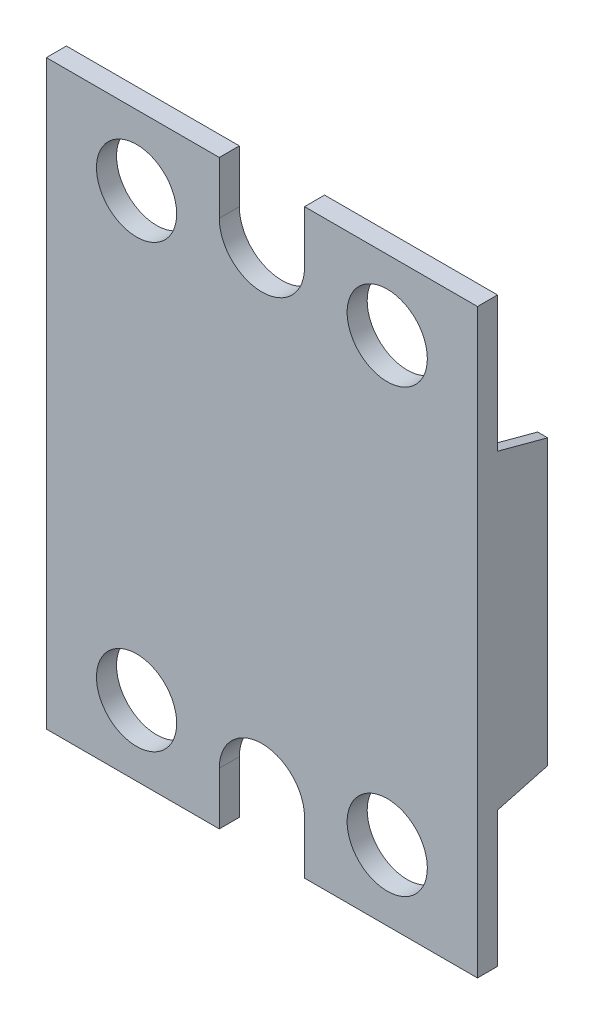
ISO-10303-21;
HEADER;
FILE_DESCRIPTION(('STEP AP214'),'2;1');
FILE_NAME('part.step','',(''),(''),'','','');
FILE_SCHEMA(('AUTOMOTIVE_DESIGN { 1 0 10303 214 1 1 1 1 }'));
ENDSEC;
DATA;
#1=APPLICATION_CONTEXT('core data for automotive mechanical design processes');
#2=APPLICATION_PROTOCOL_DEFINITION('international standard','automotive_design',2000,#1);
#3=PRODUCT_CONTEXT('',#1,'mechanical');
#4=PRODUCT('Part','Part','',(#3));
#5=PRODUCT_RELATED_PRODUCT_CATEGORY('part','',(#4));
#6=PRODUCT_DEFINITION_FORMATION('','',#4);
#7=PRODUCT_DEFINITION_CONTEXT('part definition',#1,'design');
#8=PRODUCT_DEFINITION('design','',#6,#7);
#9=PRODUCT_DEFINITION_SHAPE('','',#8);
#10=(LENGTH_UNIT() NAMED_UNIT(*) SI_UNIT(.MILLI.,.METRE.));
#11=(NAMED_UNIT(*) PLANE_ANGLE_UNIT() SI_UNIT($,.RADIAN.));
#12=(NAMED_UNIT(*) SI_UNIT($,.STERADIAN.) SOLID_ANGLE_UNIT());
#13=UNCERTAINTY_MEASURE_WITH_UNIT(LENGTH_MEASURE(1.E-05),#10,'distance_accuracy_value','');
#14=(GEOMETRIC_REPRESENTATION_CONTEXT(3) GLOBAL_UNCERTAINTY_ASSIGNED_CONTEXT((#13)) GLOBAL_UNIT_ASSIGNED_CONTEXT((#10,
#11,#12)) REPRESENTATION_CONTEXT('',''));
#15=CARTESIAN_POINT('',(0.,0.,0.));
#16=DIRECTION('',(0.,0.,1.));
#17=DIRECTION('',(1.,0.,0.));
#18=AXIS2_PLACEMENT_3D('',#15,#16,#17);
#19=CARTESIAN_POINT('',(0.,0.,-2.));
#20=DIRECTION('',(0.,0.,-1.));
#21=DIRECTION('',(-1.,0.,0.));
#22=AXIS2_PLACEMENT_3D('',#19,#20,#21);
#23=PLANE('',#22);
#24=CARTESIAN_POINT('',(12.5,22.,-2.));
#25=DIRECTION('',(0.,0.,-1.));
#26=DIRECTION('',(-1.,0.,0.));
#27=AXIS2_PLACEMENT_3D('',#24,#25,#26);
#28=CIRCLE('',#27,3.99999999999999);
#29=CARTESIAN_POINT('',(8.50000000000001,22.,-2.));
#30=VERTEX_POINT('',#29);
#31=EDGE_CURVE('E462',#30,#30,#28,.T.);
#32=ORIENTED_EDGE('',*,*,#31,.F.);
#33=EDGE_LOOP('',(#32));
#34=FACE_BOUND('',#33,.T.);
#35=CARTESIAN_POINT('',(-12.5,22.,-2.));
#36=DIRECTION('',(0.,0.,-1.));
#37=DIRECTION('',(-1.,0.,0.));
#38=AXIS2_PLACEMENT_3D('',#35,#36,#37);
#39=CIRCLE('',#38,3.99999999999999);
#40=CARTESIAN_POINT('',(-16.5,22.,-2.));
#41=VERTEX_POINT('',#40);
#42=EDGE_CURVE('E458',#41,#41,#39,.T.);
#43=ORIENTED_EDGE('',*,*,#42,.F.);
#44=EDGE_LOOP('',(#43));
#45=FACE_BOUND('',#44,.T.);
#46=CARTESIAN_POINT('',(-12.5,-22.,-2.));
#47=DIRECTION('',(0.,0.,-1.));
#48=DIRECTION('',(-1.,0.,0.));
#49=AXIS2_PLACEMENT_3D('',#46,#47,#48);
#50=CIRCLE('',#49,3.99999999999999);
#51=CARTESIAN_POINT('',(-16.5,-22.,-2.));
#52=VERTEX_POINT('',#51);
#53=EDGE_CURVE('E451',#52,#52,#50,.T.);
#54=ORIENTED_EDGE('',*,*,#53,.F.);
#55=EDGE_LOOP('',(#54));
#56=FACE_BOUND('',#55,.T.);
#57=CARTESIAN_POINT('',(12.5,-22.,-2.));
#58=DIRECTION('',(0.,0.,-1.));
#59=DIRECTION('',(-1.,0.,0.));
#60=AXIS2_PLACEMENT_3D('',#57,#58,#59);
#61=CIRCLE('',#60,3.99999999999999);
#62=CARTESIAN_POINT('',(8.50000000000001,-22.,-2.));
#63=VERTEX_POINT('',#62);
#64=EDGE_CURVE('E329',#63,#63,#61,.T.);
#65=ORIENTED_EDGE('',*,*,#64,.F.);
#66=EDGE_LOOP('',(#65));
#67=FACE_BOUND('',#66,.T.);
#68=DIRECTION('',(0.,-1.,0.));
#69=VECTOR('',#68,1.);
#70=CARTESIAN_POINT('',(-20.5,-15.5,-2.));
#71=LINE('',#70,#69);
#72=CARTESIAN_POINT('',(-20.5,15.5,-2.));
#73=VERTEX_POINT('',#72);
#74=CARTESIAN_POINT('',(-20.5,-15.5,-2.));
#75=VERTEX_POINT('',#74);
#76=EDGE_CURVE('E52',#73,#75,#71,.T.);
#77=ORIENTED_EDGE('',*,*,#76,.F.);
#78=DIRECTION('',(1.,0.,0.));
#79=VECTOR('',#78,1.);
#80=CARTESIAN_POINT('',(-20.5,15.5,-2.));
#81=LINE('',#80,#79);
#82=CARTESIAN_POINT('',(-21.5,15.5,-2.));
#83=VERTEX_POINT('',#82);
#84=EDGE_CURVE('E326',#83,#73,#81,.T.);
#85=ORIENTED_EDGE('',*,*,#84,.F.);
#86=DIRECTION('',(0.,1.,0.));
#87=VECTOR('',#86,1.);
#88=CARTESIAN_POINT('',(-21.5,-29.,-2.));
#89=LINE('',#88,#87);
#90=CARTESIAN_POINT('',(-21.5,29.,-2.));
#91=VERTEX_POINT('',#90);
#92=EDGE_CURVE('E199',#83,#91,#89,.T.);
#93=ORIENTED_EDGE('',*,*,#92,.T.);
#94=DIRECTION('',(1.,0.,0.));
#95=VECTOR('',#94,1.);
#96=CARTESIAN_POINT('',(-21.5,29.,-2.));
#97=LINE('',#96,#95);
#98=CARTESIAN_POINT('',(-4.25,29.,-2.));
#99=VERTEX_POINT('',#98);
#100=EDGE_CURVE('E204',#91,#99,#97,.T.);
#101=ORIENTED_EDGE('',*,*,#100,.T.);
#102=DIRECTION('',(0.,-1.,0.));
#103=VECTOR('',#102,1.);
#104=CARTESIAN_POINT('',(-4.25,29.,-2.));
#105=LINE('',#104,#103);
#106=CARTESIAN_POINT('',(-4.25,23.75,-2.));
#107=VERTEX_POINT('',#106);
#108=EDGE_CURVE('E154',#99,#107,#105,.T.);
#109=ORIENTED_EDGE('',*,*,#108,.T.);
#110=CARTESIAN_POINT('',(0.,23.75,-2.));
#111=DIRECTION('',(0.,0.,1.));
#112=DIRECTION('',(1.,0.,0.));
#113=AXIS2_PLACEMENT_3D('',#110,#111,#112);
#114=CIRCLE('',#113,4.25);
#115=CARTESIAN_POINT('',(4.25,23.75,-2.));
#116=VERTEX_POINT('',#115);
#117=EDGE_CURVE('E158',#107,#116,#114,.T.);
#118=ORIENTED_EDGE('',*,*,#117,.T.);
#119=DIRECTION('',(0.,1.,0.));
#120=VECTOR('',#119,1.);
#121=CARTESIAN_POINT('',(4.25,23.75,-2.));
#122=LINE('',#121,#120);
#123=CARTESIAN_POINT('',(4.25,29.,-2.));
#124=VERTEX_POINT('',#123);
#125=EDGE_CURVE('E151',#116,#124,#122,.T.);
#126=ORIENTED_EDGE('',*,*,#125,.T.);
#127=CARTESIAN_POINT('',(21.5,29.,-2.));
#128=VERTEX_POINT('',#127);
#129=EDGE_CURVE('E203',#124,#128,#97,.T.);
#130=ORIENTED_EDGE('',*,*,#129,.T.);
#131=DIRECTION('',(0.,-1.,0.));
#132=VECTOR('',#131,1.);
#133=CARTESIAN_POINT('',(21.5,29.,-2.));
#134=LINE('',#133,#132);
#135=CARTESIAN_POINT('',(21.5,15.5,-2.));
#136=VERTEX_POINT('',#135);
#137=EDGE_CURVE('E209',#128,#136,#134,.T.);
#138=ORIENTED_EDGE('',*,*,#137,.T.);
#139=DIRECTION('',(1.,0.,0.));
#140=VECTOR('',#139,1.);
#141=CARTESIAN_POINT('',(21.5,15.5,-2.));
#142=LINE('',#141,#140);
#143=CARTESIAN_POINT('',(20.5,15.5,-2.));
#144=VERTEX_POINT('',#143);
#145=EDGE_CURVE('E99',#144,#136,#142,.T.);
#146=ORIENTED_EDGE('',*,*,#145,.F.);
#147=DIRECTION('',(0.,1.,0.));
#148=VECTOR('',#147,1.);
#149=CARTESIAN_POINT('',(20.5,15.5,-2.));
#150=LINE('',#149,#148);
#151=CARTESIAN_POINT('',(20.5,-15.5,-2.));
#152=VERTEX_POINT('',#151);
#153=EDGE_CURVE('E113',#152,#144,#150,.T.);
#154=ORIENTED_EDGE('',*,*,#153,.F.);
#155=DIRECTION('',(-1.,0.,0.));
#156=VECTOR('',#155,1.);
#157=CARTESIAN_POINT('',(20.5,-15.5,-2.));
#158=LINE('',#157,#156);
#159=CARTESIAN_POINT('',(21.5,-15.5,-2.));
#160=VERTEX_POINT('',#159);
#161=EDGE_CURVE('E116',#160,#152,#158,.T.);
#162=ORIENTED_EDGE('',*,*,#161,.F.);
#163=CARTESIAN_POINT('',(21.5,-29.,-2.));
#164=VERTEX_POINT('',#163);
#165=EDGE_CURVE('E207',#160,#164,#134,.T.);
#166=ORIENTED_EDGE('',*,*,#165,.T.);
#167=DIRECTION('',(-1.,0.,0.));
#168=VECTOR('',#167,1.);
#169=CARTESIAN_POINT('',(21.5,-29.,-2.));
#170=LINE('',#169,#168);
#171=CARTESIAN_POINT('',(4.25,-29.,-2.));
#172=VERTEX_POINT('',#171);
#173=EDGE_CURVE('E196',#164,#172,#170,.T.);
#174=ORIENTED_EDGE('',*,*,#173,.T.);
#175=DIRECTION('',(0.,1.,0.));
#176=VECTOR('',#175,1.);
#177=CARTESIAN_POINT('',(4.25,-29.,-2.));
#178=LINE('',#177,#176);
#179=CARTESIAN_POINT('',(4.25,-23.75,-2.));
#180=VERTEX_POINT('',#179);
#181=EDGE_CURVE('E122',#172,#180,#178,.T.);
#182=ORIENTED_EDGE('',*,*,#181,.T.);
#183=CARTESIAN_POINT('',(0.,-23.75,-2.));
#184=DIRECTION('',(0.,0.,1.));
#185=DIRECTION('',(1.,0.,0.));
#186=AXIS2_PLACEMENT_3D('',#183,#184,#185);
#187=CIRCLE('',#186,4.25);
#188=CARTESIAN_POINT('',(-4.25,-23.75,-2.));
#189=VERTEX_POINT('',#188);
#190=EDGE_CURVE('E126',#180,#189,#187,.T.);
#191=ORIENTED_EDGE('',*,*,#190,.T.);
#192=DIRECTION('',(0.,-1.,0.));
#193=VECTOR('',#192,1.);
#194=CARTESIAN_POINT('',(-4.25,-23.75,-2.));
#195=LINE('',#194,#193);
#196=CARTESIAN_POINT('',(-4.25,-29.,-2.));
#197=VERTEX_POINT('',#196);
#198=EDGE_CURVE('E119',#189,#197,#195,.T.);
#199=ORIENTED_EDGE('',*,*,#198,.T.);
#200=CARTESIAN_POINT('',(-21.5,-29.,-2.));
#201=VERTEX_POINT('',#200);
#202=EDGE_CURVE('E172',#197,#201,#170,.T.);
#203=ORIENTED_EDGE('',*,*,#202,.T.);
#204=CARTESIAN_POINT('',(-21.5,-15.5,-2.));
#205=VERTEX_POINT('',#204);
#206=EDGE_CURVE('E200',#201,#205,#89,.T.);
#207=ORIENTED_EDGE('',*,*,#206,.T.);
#208=DIRECTION('',(-1.,0.,0.));
#209=VECTOR('',#208,1.);
#210=CARTESIAN_POINT('',(-21.5,-15.5,-2.));
#211=LINE('',#210,#209);
#212=EDGE_CURVE('E240',#75,#205,#211,.T.);
#213=ORIENTED_EDGE('',*,*,#212,.F.);
#214=EDGE_LOOP('',(#77,#85,#93,#101,#109,#118,#126,#130,#138,#146,#154,#162,#166,#174,#182,#191,
#199,#203,#207,#213));
#215=FACE_BOUND('',#214,.T.);
#216=ADVANCED_FACE('F33',(#34,#45,#56,#67,#215),#23,.T.);
#217=CARTESIAN_POINT('',(21.5,-29.,0.));
#218=DIRECTION('',(0.,-1.,0.));
#219=DIRECTION('',(0.,0.,-1.));
#220=AXIS2_PLACEMENT_3D('',#217,#218,#219);
#221=PLANE('',#220);
#222=DIRECTION('',(0.,0.,1.));
#223=VECTOR('',#222,1.);
#224=CARTESIAN_POINT('',(-4.25,-29.,-2.));
#225=LINE('',#224,#223);
#226=CARTESIAN_POINT('',(-4.25,-29.,0.));
#227=VERTEX_POINT('',#226);
#228=EDGE_CURVE('E129',#197,#227,#225,.T.);
#229=ORIENTED_EDGE('',*,*,#228,.T.);
#230=DIRECTION('',(-1.,0.,0.));
#231=VECTOR('',#230,1.);
#232=CARTESIAN_POINT('',(21.5,-29.,0.));
#233=LINE('',#232,#231);
#234=CARTESIAN_POINT('',(-21.5,-29.,0.));
#235=VERTEX_POINT('',#234);
#236=EDGE_CURVE('E185',#227,#235,#233,.T.);
#237=ORIENTED_EDGE('',*,*,#236,.T.);
#238=DIRECTION('',(0.,0.,-1.));
#239=VECTOR('',#238,1.);
#240=CARTESIAN_POINT('',(-21.5,-29.,0.));
#241=LINE('',#240,#239);
#242=EDGE_CURVE('E195',#235,#201,#241,.T.);
#243=ORIENTED_EDGE('',*,*,#242,.T.);
#244=ORIENTED_EDGE('',*,*,#202,.F.);
#245=EDGE_LOOP('',(#229,#237,#243,#244));
#246=FACE_BOUND('',#245,.T.);
#247=ADVANCED_FACE('F348',(#246),#221,.T.);
#248=CARTESIAN_POINT('',(-21.5,29.,0.));
#249=DIRECTION('',(0.,1.,0.));
#250=DIRECTION('',(0.,0.,1.));
#251=AXIS2_PLACEMENT_3D('',#248,#249,#250);
#252=PLANE('',#251);
#253=DIRECTION('',(0.,0.,1.));
#254=VECTOR('',#253,1.);
#255=CARTESIAN_POINT('',(4.25,29.,-2.));
#256=LINE('',#255,#254);
#257=CARTESIAN_POINT('',(4.25,29.,0.));
#258=VERTEX_POINT('',#257);
#259=EDGE_CURVE('E161',#124,#258,#256,.T.);
#260=ORIENTED_EDGE('',*,*,#259,.T.);
#261=DIRECTION('',(1.,0.,0.));
#262=VECTOR('',#261,1.);
#263=CARTESIAN_POINT('',(-21.5,29.,0.));
#264=LINE('',#263,#262);
#265=CARTESIAN_POINT('',(21.5,29.,0.));
#266=VERTEX_POINT('',#265);
#267=EDGE_CURVE('E188',#258,#266,#264,.T.);
#268=ORIENTED_EDGE('',*,*,#267,.T.);
#269=DIRECTION('',(0.,0.,-1.));
#270=VECTOR('',#269,1.);
#271=CARTESIAN_POINT('',(21.5,29.,0.));
#272=LINE('',#271,#270);
#273=EDGE_CURVE('E43',#266,#128,#272,.T.);
#274=ORIENTED_EDGE('',*,*,#273,.T.);
#275=ORIENTED_EDGE('',*,*,#129,.F.);
#276=EDGE_LOOP('',(#260,#268,#274,#275));
#277=FACE_BOUND('',#276,.T.);
#278=ADVANCED_FACE('F387',(#277),#252,.T.);
#279=DIRECTION('',(0.,0.,1.));
#280=VECTOR('',#279,1.);
#281=CARTESIAN_POINT('',(4.25,-29.,-2.));
#282=LINE('',#281,#280);
#283=CARTESIAN_POINT('',(4.25,-29.,0.));
#284=VERTEX_POINT('',#283);
#285=EDGE_CURVE('E146',#172,#284,#282,.T.);
#286=ORIENTED_EDGE('',*,*,#285,.F.);
#287=ORIENTED_EDGE('',*,*,#173,.F.);
#288=DIRECTION('',(0.,0.,-1.));
#289=VECTOR('',#288,1.);
#290=CARTESIAN_POINT('',(21.5,-29.,0.));
#291=LINE('',#290,#289);
#292=CARTESIAN_POINT('',(21.5,-29.,0.));
#293=VERTEX_POINT('',#292);
#294=EDGE_CURVE('E11',#293,#164,#291,.T.);
#295=ORIENTED_EDGE('',*,*,#294,.F.);
#296=EDGE_CURVE('E181',#293,#284,#233,.T.);
#297=ORIENTED_EDGE('',*,*,#296,.T.);
#298=EDGE_LOOP('',(#286,#287,#295,#297));
#299=FACE_BOUND('',#298,.T.);
#300=ADVANCED_FACE('F364',(#299),#221,.T.);
#301=CARTESIAN_POINT('',(21.5,29.,0.));
#302=DIRECTION('',(1.,0.,0.));
#303=DIRECTION('',(0.,0.,-1.));
#304=AXIS2_PLACEMENT_3D('',#301,#302,#303);
#305=PLANE('',#304);
#306=ORIENTED_EDGE('',*,*,#137,.F.);
#307=ORIENTED_EDGE('',*,*,#273,.F.);
#308=DIRECTION('',(0.,-1.,0.));
#309=VECTOR('',#308,1.);
#310=CARTESIAN_POINT('',(21.5,29.,0.));
#311=LINE('',#310,#309);
#312=EDGE_CURVE('E192',#266,#293,#311,.T.);
#313=ORIENTED_EDGE('',*,*,#312,.T.);
#314=ORIENTED_EDGE('',*,*,#294,.T.);
#315=ORIENTED_EDGE('',*,*,#165,.F.);
#316=DIRECTION('',(0.,0.258819045102524,-0.965925826289068));
#317=VECTOR('',#316,1.);
#318=CARTESIAN_POINT('',(21.5,-13.0190652342037,-11.2589745962157));
#319=LINE('',#318,#317);
#320=CARTESIAN_POINT('',(21.5,-14.1602540378444,-7.));
#321=VERTEX_POINT('',#320);
#322=EDGE_CURVE('E103',#321,#160,#319,.F.);
#323=ORIENTED_EDGE('',*,*,#322,.F.);
#324=DIRECTION('',(0.,-1.,0.));
#325=VECTOR('',#324,1.);
#326=CARTESIAN_POINT('',(21.5,-15.5,-7.));
#327=LINE('',#326,#325);
#328=CARTESIAN_POINT('',(21.5,14.1602540378444,-7.));
#329=VERTEX_POINT('',#328);
#330=EDGE_CURVE('E90',#329,#321,#327,.T.);
#331=ORIENTED_EDGE('',*,*,#330,.F.);
#332=DIRECTION('',(0.,-0.258819045102524,-0.965925826289068));
#333=VECTOR('',#332,1.);
#334=CARTESIAN_POINT('',(21.5,15.5,-2.));
#335=LINE('',#334,#333);
#336=EDGE_CURVE('E37',#329,#136,#335,.F.);
#337=ORIENTED_EDGE('',*,*,#336,.T.);
#338=EDGE_LOOP('',(#306,#307,#313,#314,#315,#323,#331,#337));
#339=FACE_BOUND('',#338,.T.);
#340=ADVANCED_FACE('F104',(#339),#305,.T.);
#341=DIRECTION('',(0.,0.,1.));
#342=VECTOR('',#341,1.);
#343=CARTESIAN_POINT('',(-4.25,29.,-2.));
#344=LINE('',#343,#342);
#345=CARTESIAN_POINT('',(-4.25,29.,0.));
#346=VERTEX_POINT('',#345);
#347=EDGE_CURVE('E176',#99,#346,#344,.T.);
#348=ORIENTED_EDGE('',*,*,#347,.F.);
#349=ORIENTED_EDGE('',*,*,#100,.F.);
#350=DIRECTION('',(0.,0.,-1.));
#351=VECTOR('',#350,1.);
#352=CARTESIAN_POINT('',(-21.5,29.,0.));
#353=LINE('',#352,#351);
#354=CARTESIAN_POINT('',(-21.5,29.,0.));
#355=VERTEX_POINT('',#354);
#356=EDGE_CURVE('E213',#355,#91,#353,.T.);
#357=ORIENTED_EDGE('',*,*,#356,.F.);
#358=EDGE_CURVE('E189',#355,#346,#264,.T.);
#359=ORIENTED_EDGE('',*,*,#358,.T.);
#360=EDGE_LOOP('',(#348,#349,#357,#359));
#361=FACE_BOUND('',#360,.T.);
#362=ADVANCED_FACE('F395',(#361),#252,.T.);
#363=CARTESIAN_POINT('',(-21.5,-29.,0.));
#364=DIRECTION('',(-1.,0.,0.));
#365=DIRECTION('',(0.,0.,1.));
#366=AXIS2_PLACEMENT_3D('',#363,#364,#365);
#367=PLANE('',#366);
#368=ORIENTED_EDGE('',*,*,#206,.F.);
#369=ORIENTED_EDGE('',*,*,#242,.F.);
#370=DIRECTION('',(0.,1.,0.));
#371=VECTOR('',#370,1.);
#372=CARTESIAN_POINT('',(-21.5,-29.,0.));
#373=LINE('',#372,#371);
#374=EDGE_CURVE('E184',#235,#355,#373,.T.);
#375=ORIENTED_EDGE('',*,*,#374,.T.);
#376=ORIENTED_EDGE('',*,*,#356,.T.);
#377=ORIENTED_EDGE('',*,*,#92,.F.);
#378=DIRECTION('',(0.,-0.258819045102524,-0.965925826289068));
#379=VECTOR('',#378,1.);
#380=CARTESIAN_POINT('',(-21.5,13.0190652342037,-11.2589745962157));
#381=LINE('',#380,#379);
#382=CARTESIAN_POINT('',(-21.5,14.1602540378444,-7.));
#383=VERTEX_POINT('',#382);
#384=EDGE_CURVE('E234',#383,#83,#381,.F.);
#385=ORIENTED_EDGE('',*,*,#384,.F.);
#386=DIRECTION('',(0.,1.,0.));
#387=VECTOR('',#386,1.);
#388=CARTESIAN_POINT('',(-21.5,15.5,-7.));
#389=LINE('',#388,#387);
#390=CARTESIAN_POINT('',(-21.5,-14.1602540378444,-7.));
#391=VERTEX_POINT('',#390);
#392=EDGE_CURVE('E230',#391,#383,#389,.T.);
#393=ORIENTED_EDGE('',*,*,#392,.F.);
#394=DIRECTION('',(0.,0.258819045102524,-0.965925826289068));
#395=VECTOR('',#394,1.);
#396=CARTESIAN_POINT('',(-21.5,-15.5,-2.));
#397=LINE('',#396,#395);
#398=EDGE_CURVE('E227',#391,#205,#397,.F.);
#399=ORIENTED_EDGE('',*,*,#398,.T.);
#400=EDGE_LOOP('',(#368,#369,#375,#376,#377,#385,#393,#399));
#401=FACE_BOUND('',#400,.T.);
#402=ADVANCED_FACE('F321',(#401),#367,.T.);
#403=CARTESIAN_POINT('',(0.,0.,0.));
#404=DIRECTION('',(0.,0.,-1.));
#405=DIRECTION('',(-1.,0.,0.));
#406=AXIS2_PLACEMENT_3D('',#403,#404,#405);
#407=PLANE('',#406);
#408=CARTESIAN_POINT('',(12.5,22.,0.));
#409=DIRECTION('',(0.,0.,1.));
#410=DIRECTION('',(1.,0.,0.));
#411=AXIS2_PLACEMENT_3D('',#408,#409,#410);
#412=CIRCLE('',#411,3.99999999999999);
#413=CARTESIAN_POINT('',(16.5,22.,0.));
#414=VERTEX_POINT('',#413);
#415=EDGE_CURVE('E438',#414,#414,#412,.T.);
#416=ORIENTED_EDGE('',*,*,#415,.F.);
#417=EDGE_LOOP('',(#416));
#418=FACE_BOUND('',#417,.T.);
#419=CARTESIAN_POINT('',(-12.5,22.,0.));
#420=DIRECTION('',(0.,0.,1.));
#421=DIRECTION('',(1.,0.,0.));
#422=AXIS2_PLACEMENT_3D('',#419,#420,#421);
#423=CIRCLE('',#422,3.99999999999999);
#424=CARTESIAN_POINT('',(-8.50000000000001,22.,0.));
#425=VERTEX_POINT('',#424);
#426=EDGE_CURVE('E442',#425,#425,#423,.T.);
#427=ORIENTED_EDGE('',*,*,#426,.F.);
#428=EDGE_LOOP('',(#427));
#429=FACE_BOUND('',#428,.T.);
#430=CARTESIAN_POINT('',(-12.5,-22.,0.));
#431=DIRECTION('',(0.,0.,1.));
#432=DIRECTION('',(1.,0.,0.));
#433=AXIS2_PLACEMENT_3D('',#430,#431,#432);
#434=CIRCLE('',#433,3.99999999999999);
#435=CARTESIAN_POINT('',(-8.50000000000001,-22.,0.));
#436=VERTEX_POINT('',#435);
#437=EDGE_CURVE('E446',#436,#436,#434,.T.);
#438=ORIENTED_EDGE('',*,*,#437,.F.);
#439=EDGE_LOOP('',(#438));
#440=FACE_BOUND('',#439,.T.);
#441=CARTESIAN_POINT('',(12.5,-22.,0.));
#442=DIRECTION('',(0.,0.,1.));
#443=DIRECTION('',(1.,0.,0.));
#444=AXIS2_PLACEMENT_3D('',#441,#442,#443);
#445=CIRCLE('',#444,3.99999999999999);
#446=CARTESIAN_POINT('',(16.5,-22.,0.));
#447=VERTEX_POINT('',#446);
#448=EDGE_CURVE('E449',#447,#447,#445,.T.);
#449=ORIENTED_EDGE('',*,*,#448,.F.);
#450=EDGE_LOOP('',(#449));
#451=FACE_BOUND('',#450,.T.);
#452=ORIENTED_EDGE('',*,*,#236,.F.);
#453=DIRECTION('',(0.,-1.,0.));
#454=VECTOR('',#453,1.);
#455=CARTESIAN_POINT('',(-4.25,-23.75,0.));
#456=LINE('',#455,#454);
#457=CARTESIAN_POINT('',(-4.25,-23.75,0.));
#458=VERTEX_POINT('',#457);
#459=EDGE_CURVE('E130',#458,#227,#456,.T.);
#460=ORIENTED_EDGE('',*,*,#459,.F.);
#461=CARTESIAN_POINT('',(0.,-23.75,0.));
#462=DIRECTION('',(0.,0.,1.));
#463=DIRECTION('',(1.,0.,0.));
#464=AXIS2_PLACEMENT_3D('',#461,#462,#463);
#465=CIRCLE('',#464,4.25);
#466=CARTESIAN_POINT('',(4.25,-23.75,0.));
#467=VERTEX_POINT('',#466);
#468=EDGE_CURVE('E123',#467,#458,#465,.T.);
#469=ORIENTED_EDGE('',*,*,#468,.F.);
#470=DIRECTION('',(0.,1.,0.));
#471=VECTOR('',#470,1.);
#472=CARTESIAN_POINT('',(4.25,-29.,0.));
#473=LINE('',#472,#471);
#474=EDGE_CURVE('E133',#284,#467,#473,.T.);
#475=ORIENTED_EDGE('',*,*,#474,.F.);
#476=ORIENTED_EDGE('',*,*,#296,.F.);
#477=ORIENTED_EDGE('',*,*,#312,.F.);
#478=ORIENTED_EDGE('',*,*,#267,.F.);
#479=DIRECTION('',(0.,1.,0.));
#480=VECTOR('',#479,1.);
#481=CARTESIAN_POINT('',(4.25,23.75,0.));
#482=LINE('',#481,#480);
#483=CARTESIAN_POINT('',(4.25,23.75,0.));
#484=VERTEX_POINT('',#483);
#485=EDGE_CURVE('E142',#484,#258,#482,.T.);
#486=ORIENTED_EDGE('',*,*,#485,.F.);
#487=CARTESIAN_POINT('',(0.,23.75,0.));
#488=DIRECTION('',(0.,0.,1.));
#489=DIRECTION('',(1.,0.,0.));
#490=AXIS2_PLACEMENT_3D('',#487,#488,#489);
#491=CIRCLE('',#490,4.25);
#492=CARTESIAN_POINT('',(-4.25,23.75,0.));
#493=VERTEX_POINT('',#492);
#494=EDGE_CURVE('E155',#493,#484,#491,.T.);
#495=ORIENTED_EDGE('',*,*,#494,.F.);
#496=DIRECTION('',(0.,-1.,0.));
#497=VECTOR('',#496,1.);
#498=CARTESIAN_POINT('',(-4.25,29.,0.));
#499=LINE('',#498,#497);
#500=EDGE_CURVE('E164',#346,#493,#499,.T.);
#501=ORIENTED_EDGE('',*,*,#500,.F.);
#502=ORIENTED_EDGE('',*,*,#358,.F.);
#503=ORIENTED_EDGE('',*,*,#374,.F.);
#504=EDGE_LOOP('',(#452,#460,#469,#475,#476,#477,#478,#486,#495,#501,#502,#503));
#505=FACE_BOUND('',#504,.T.);
#506=ADVANCED_FACE('F358',(#418,#429,#440,#451,#505),#407,.F.);
#507=CARTESIAN_POINT('',(4.25,23.75,-2.));
#508=DIRECTION('',(1.,0.,0.));
#509=DIRECTION('',(0.,0.,-1.));
#510=AXIS2_PLACEMENT_3D('',#507,#508,#509);
#511=PLANE('',#510);
#512=ORIENTED_EDGE('',*,*,#485,.T.);
#513=ORIENTED_EDGE('',*,*,#259,.F.);
#514=ORIENTED_EDGE('',*,*,#125,.F.);
#515=DIRECTION('',(0.,0.,1.));
#516=VECTOR('',#515,1.);
#517=CARTESIAN_POINT('',(4.25,23.75,-2.));
#518=LINE('',#517,#516);
#519=EDGE_CURVE('E169',#116,#484,#518,.T.);
#520=ORIENTED_EDGE('',*,*,#519,.T.);
#521=EDGE_LOOP('',(#512,#513,#514,#520));
#522=FACE_BOUND('',#521,.T.);
#523=ADVANCED_FACE('F408',(#522),#511,.F.);
#524=CARTESIAN_POINT('',(0.,23.75,-2.));
#525=DIRECTION('',(0.,0.,1.));
#526=DIRECTION('',(1.,0.,0.));
#527=AXIS2_PLACEMENT_3D('',#524,#525,#526);
#528=CYLINDRICAL_SURFACE('',#527,4.25);
#529=ORIENTED_EDGE('',*,*,#494,.T.);
#530=ORIENTED_EDGE('',*,*,#519,.F.);
#531=ORIENTED_EDGE('',*,*,#117,.F.);
#532=DIRECTION('',(0.,0.,1.));
#533=VECTOR('',#532,1.);
#534=CARTESIAN_POINT('',(-4.25,23.75,-2.));
#535=LINE('',#534,#533);
#536=EDGE_CURVE('E173',#107,#493,#535,.T.);
#537=ORIENTED_EDGE('',*,*,#536,.T.);
#538=EDGE_LOOP('',(#529,#530,#531,#537));
#539=FACE_BOUND('',#538,.T.);
#540=ADVANCED_FACE('F411',(#539),#528,.F.);
#541=CARTESIAN_POINT('',(-4.25,29.,-2.));
#542=DIRECTION('',(-1.,0.,0.));
#543=DIRECTION('',(0.,0.,1.));
#544=AXIS2_PLACEMENT_3D('',#541,#542,#543);
#545=PLANE('',#544);
#546=ORIENTED_EDGE('',*,*,#500,.T.);
#547=ORIENTED_EDGE('',*,*,#536,.F.);
#548=ORIENTED_EDGE('',*,*,#108,.F.);
#549=ORIENTED_EDGE('',*,*,#347,.T.);
#550=EDGE_LOOP('',(#546,#547,#548,#549));
#551=FACE_BOUND('',#550,.T.);
#552=ADVANCED_FACE('F413',(#551),#545,.F.);
#553=CARTESIAN_POINT('',(-4.25,-23.75,-2.));
#554=DIRECTION('',(-1.,0.,0.));
#555=DIRECTION('',(0.,0.,1.));
#556=AXIS2_PLACEMENT_3D('',#553,#554,#555);
#557=PLANE('',#556);
#558=ORIENTED_EDGE('',*,*,#459,.T.);
#559=ORIENTED_EDGE('',*,*,#228,.F.);
#560=ORIENTED_EDGE('',*,*,#198,.F.);
#561=DIRECTION('',(0.,0.,1.));
#562=VECTOR('',#561,1.);
#563=CARTESIAN_POINT('',(-4.25,-23.75,-2.));
#564=LINE('',#563,#562);
#565=EDGE_CURVE('E139',#189,#458,#564,.T.);
#566=ORIENTED_EDGE('',*,*,#565,.T.);
#567=EDGE_LOOP('',(#558,#559,#560,#566));
#568=FACE_BOUND('',#567,.T.);
#569=ADVANCED_FACE('F419',(#568),#557,.F.);
#570=CARTESIAN_POINT('',(0.,-23.75,-2.));
#571=DIRECTION('',(0.,0.,1.));
#572=DIRECTION('',(1.,0.,0.));
#573=AXIS2_PLACEMENT_3D('',#570,#571,#572);
#574=CYLINDRICAL_SURFACE('',#573,4.25);
#575=ORIENTED_EDGE('',*,*,#468,.T.);
#576=ORIENTED_EDGE('',*,*,#565,.F.);
#577=ORIENTED_EDGE('',*,*,#190,.F.);
#578=DIRECTION('',(0.,0.,1.));
#579=VECTOR('',#578,1.);
#580=CARTESIAN_POINT('',(4.25,-23.75,-2.));
#581=LINE('',#580,#579);
#582=EDGE_CURVE('E143',#180,#467,#581,.T.);
#583=ORIENTED_EDGE('',*,*,#582,.T.);
#584=EDGE_LOOP('',(#575,#576,#577,#583));
#585=FACE_BOUND('',#584,.T.);
#586=ADVANCED_FACE('F376',(#585),#574,.F.);
#587=CARTESIAN_POINT('',(4.25,-29.,-2.));
#588=DIRECTION('',(1.,0.,0.));
#589=DIRECTION('',(0.,0.,-1.));
#590=AXIS2_PLACEMENT_3D('',#587,#588,#589);
#591=PLANE('',#590);
#592=ORIENTED_EDGE('',*,*,#474,.T.);
#593=ORIENTED_EDGE('',*,*,#582,.F.);
#594=ORIENTED_EDGE('',*,*,#181,.F.);
#595=ORIENTED_EDGE('',*,*,#285,.T.);
#596=EDGE_LOOP('',(#592,#593,#594,#595));
#597=FACE_BOUND('',#596,.T.);
#598=ADVANCED_FACE('F369',(#597),#591,.F.);
#599=CARTESIAN_POINT('',(20.5,-15.5,-2.));
#600=DIRECTION('',(0.,-0.965925826289067,-0.258819045102524));
#601=DIRECTION('',(0.,0.258819045102524,-0.965925826289068));
#602=AXIS2_PLACEMENT_3D('',#599,#600,#601);
#603=PLANE('',#602);
#604=ORIENTED_EDGE('',*,*,#161,.T.);
#605=DIRECTION('',(0.,0.258819045102524,-0.965925826289068));
#606=VECTOR('',#605,1.);
#607=CARTESIAN_POINT('',(20.5,-12.1733937586587,-14.4150635094612));
#608=LINE('',#607,#606);
#609=CARTESIAN_POINT('',(20.5,-14.1602540378444,-7.));
#610=VERTEX_POINT('',#609);
#611=EDGE_CURVE('E134',#610,#152,#608,.F.);
#612=ORIENTED_EDGE('',*,*,#611,.F.);
#613=DIRECTION('',(1.,0.,0.));
#614=VECTOR('',#613,1.);
#615=CARTESIAN_POINT('',(0.,-14.1602540378444,-7.));
#616=LINE('',#615,#614);
#617=EDGE_CURVE('E118',#321,#610,#616,.F.);
#618=ORIENTED_EDGE('',*,*,#617,.F.);
#619=ORIENTED_EDGE('',*,*,#322,.T.);
#620=EDGE_LOOP('',(#604,#612,#618,#619));
#621=FACE_BOUND('',#620,.T.);
#622=ADVANCED_FACE('F367',(#621),#603,.T.);
#623=CARTESIAN_POINT('',(20.5,15.5,-7.));
#624=DIRECTION('',(1.,0.,0.));
#625=DIRECTION('',(0.,0.,-1.));
#626=AXIS2_PLACEMENT_3D('',#623,#624,#625);
#627=PLANE('',#626);
#628=ORIENTED_EDGE('',*,*,#153,.T.);
#629=DIRECTION('',(0.,-0.258819045102524,-0.965925826289068));
#630=VECTOR('',#629,1.);
#631=CARTESIAN_POINT('',(20.5,15.5,-2.));
#632=LINE('',#631,#630);
#633=CARTESIAN_POINT('',(20.5,14.1602540378444,-7.));
#634=VERTEX_POINT('',#633);
#635=EDGE_CURVE('E102',#634,#144,#632,.F.);
#636=ORIENTED_EDGE('',*,*,#635,.F.);
#637=DIRECTION('',(0.,1.,0.));
#638=VECTOR('',#637,1.);
#639=CARTESIAN_POINT('',(20.5,15.5,-7.));
#640=LINE('',#639,#638);
#641=EDGE_CURVE('E83',#610,#634,#640,.T.);
#642=ORIENTED_EDGE('',*,*,#641,.F.);
#643=ORIENTED_EDGE('',*,*,#611,.T.);
#644=EDGE_LOOP('',(#628,#636,#642,#643));
#645=FACE_BOUND('',#644,.T.);
#646=ADVANCED_FACE('F244',(#645),#627,.F.);
#647=CARTESIAN_POINT('',(21.5,15.5,-2.));
#648=DIRECTION('',(0.,0.965925826289067,-0.258819045102524));
#649=DIRECTION('',(0.,0.258819045102524,0.965925826289068));
#650=AXIS2_PLACEMENT_3D('',#647,#648,#649);
#651=PLANE('',#650);
#652=ORIENTED_EDGE('',*,*,#145,.T.);
#653=ORIENTED_EDGE('',*,*,#336,.F.);
#654=DIRECTION('',(-1.,0.,0.));
#655=VECTOR('',#654,1.);
#656=CARTESIAN_POINT('',(0.,14.1602540378444,-7.));
#657=LINE('',#656,#655);
#658=EDGE_CURVE('E86',#634,#329,#657,.F.);
#659=ORIENTED_EDGE('',*,*,#658,.F.);
#660=ORIENTED_EDGE('',*,*,#635,.T.);
#661=EDGE_LOOP('',(#652,#653,#659,#660));
#662=FACE_BOUND('',#661,.T.);
#663=ADVANCED_FACE('F96',(#662),#651,.T.);
#664=CARTESIAN_POINT('',(0.,0.,-7.));
#665=DIRECTION('',(0.,0.,1.));
#666=DIRECTION('',(1.,0.,0.));
#667=AXIS2_PLACEMENT_3D('',#664,#665,#666);
#668=PLANE('',#667);
#669=ORIENTED_EDGE('',*,*,#617,.T.);
#670=ORIENTED_EDGE('',*,*,#641,.T.);
#671=ORIENTED_EDGE('',*,*,#658,.T.);
#672=ORIENTED_EDGE('',*,*,#330,.T.);
#673=EDGE_LOOP('',(#669,#670,#671,#672));
#674=FACE_BOUND('',#673,.T.);
#675=ADVANCED_FACE('F88',(#674),#668,.F.);
#676=CARTESIAN_POINT('',(-20.5,15.5,-2.));
#677=DIRECTION('',(0.,0.965925826289067,-0.258819045102524));
#678=DIRECTION('',(0.,0.258819045102524,0.965925826289068));
#679=AXIS2_PLACEMENT_3D('',#676,#677,#678);
#680=PLANE('',#679);
#681=ORIENTED_EDGE('',*,*,#84,.T.);
#682=DIRECTION('',(0.,-0.258819045102524,-0.965925826289068));
#683=VECTOR('',#682,1.);
#684=CARTESIAN_POINT('',(-20.5,12.1733937586587,-14.4150635094612));
#685=LINE('',#684,#683);
#686=CARTESIAN_POINT('',(-20.5,14.1602540378444,-7.));
#687=VERTEX_POINT('',#686);
#688=EDGE_CURVE('E219',#687,#73,#685,.F.);
#689=ORIENTED_EDGE('',*,*,#688,.F.);
#690=DIRECTION('',(-1.,0.,0.));
#691=VECTOR('',#690,1.);
#692=CARTESIAN_POINT('',(0.,14.1602540378444,-7.));
#693=LINE('',#692,#691);
#694=EDGE_CURVE('E237',#383,#687,#693,.F.);
#695=ORIENTED_EDGE('',*,*,#694,.F.);
#696=ORIENTED_EDGE('',*,*,#384,.T.);
#697=EDGE_LOOP('',(#681,#689,#695,#696));
#698=FACE_BOUND('',#697,.T.);
#699=ADVANCED_FACE('F331',(#698),#680,.T.);
#700=CARTESIAN_POINT('',(-20.5,-15.5,-7.));
#701=DIRECTION('',(-1.,0.,0.));
#702=DIRECTION('',(0.,0.,1.));
#703=AXIS2_PLACEMENT_3D('',#700,#701,#702);
#704=PLANE('',#703);
#705=ORIENTED_EDGE('',*,*,#76,.T.);
#706=DIRECTION('',(0.,0.258819045102524,-0.965925826289068));
#707=VECTOR('',#706,1.);
#708=CARTESIAN_POINT('',(-20.5,-15.5,-2.));
#709=LINE('',#708,#707);
#710=CARTESIAN_POINT('',(-20.5,-14.1602540378444,-7.));
#711=VERTEX_POINT('',#710);
#712=EDGE_CURVE('E224',#711,#75,#709,.F.);
#713=ORIENTED_EDGE('',*,*,#712,.F.);
#714=DIRECTION('',(0.,-1.,0.));
#715=VECTOR('',#714,1.);
#716=CARTESIAN_POINT('',(-20.5,-15.5,-7.));
#717=LINE('',#716,#715);
#718=EDGE_CURVE('E231',#687,#711,#717,.T.);
#719=ORIENTED_EDGE('',*,*,#718,.F.);
#720=ORIENTED_EDGE('',*,*,#688,.T.);
#721=EDGE_LOOP('',(#705,#713,#719,#720));
#722=FACE_BOUND('',#721,.T.);
#723=ADVANCED_FACE('F487',(#722),#704,.F.);
#724=CARTESIAN_POINT('',(-21.5,-15.5,-2.));
#725=DIRECTION('',(0.,-0.965925826289067,-0.258819045102524));
#726=DIRECTION('',(0.,0.258819045102524,-0.965925826289068));
#727=AXIS2_PLACEMENT_3D('',#724,#725,#726);
#728=PLANE('',#727);
#729=ORIENTED_EDGE('',*,*,#212,.T.);
#730=ORIENTED_EDGE('',*,*,#398,.F.);
#731=DIRECTION('',(1.,0.,0.));
#732=VECTOR('',#731,1.);
#733=CARTESIAN_POINT('',(0.,-14.1602540378444,-7.));
#734=LINE('',#733,#732);
#735=EDGE_CURVE('E228',#711,#391,#734,.F.);
#736=ORIENTED_EDGE('',*,*,#735,.F.);
#737=ORIENTED_EDGE('',*,*,#712,.T.);
#738=EDGE_LOOP('',(#729,#730,#736,#737));
#739=FACE_BOUND('',#738,.T.);
#740=ADVANCED_FACE('F35',(#739),#728,.T.);
#741=CARTESIAN_POINT('',(0.,0.,-7.));
#742=DIRECTION('',(0.,0.,1.));
#743=DIRECTION('',(1.,0.,0.));
#744=AXIS2_PLACEMENT_3D('',#741,#742,#743);
#745=PLANE('',#744);
#746=ORIENTED_EDGE('',*,*,#694,.T.);
#747=ORIENTED_EDGE('',*,*,#718,.T.);
#748=ORIENTED_EDGE('',*,*,#735,.T.);
#749=ORIENTED_EDGE('',*,*,#392,.T.);
#750=EDGE_LOOP('',(#746,#747,#748,#749));
#751=FACE_BOUND('',#750,.T.);
#752=ADVANCED_FACE('F333',(#751),#745,.F.);
#753=CARTESIAN_POINT('',(12.5,-22.,0.));
#754=DIRECTION('',(0.,0.,1.));
#755=DIRECTION('',(1.,0.,0.));
#756=AXIS2_PLACEMENT_3D('',#753,#754,#755);
#757=CYLINDRICAL_SURFACE('',#756,3.99999999999999);
#758=ORIENTED_EDGE('',*,*,#64,.T.);
#759=EDGE_LOOP('',(#758));
#760=FACE_BOUND('',#759,.T.);
#761=ORIENTED_EDGE('',*,*,#448,.T.);
#762=EDGE_LOOP('',(#761));
#763=FACE_BOUND('',#762,.T.);
#764=ADVANCED_FACE('F480',(#760,#763),#757,.F.);
#765=CARTESIAN_POINT('',(-12.5,-22.,0.));
#766=DIRECTION('',(0.,0.,1.));
#767=DIRECTION('',(1.,0.,0.));
#768=AXIS2_PLACEMENT_3D('',#765,#766,#767);
#769=CYLINDRICAL_SURFACE('',#768,3.99999999999999);
#770=ORIENTED_EDGE('',*,*,#53,.T.);
#771=EDGE_LOOP('',(#770));
#772=FACE_BOUND('',#771,.T.);
#773=ORIENTED_EDGE('',*,*,#437,.T.);
#774=EDGE_LOOP('',(#773));
#775=FACE_BOUND('',#774,.T.);
#776=ADVANCED_FACE('F474',(#772,#775),#769,.F.);
#777=CARTESIAN_POINT('',(-12.5,22.,0.));
#778=DIRECTION('',(0.,0.,1.));
#779=DIRECTION('',(1.,0.,0.));
#780=AXIS2_PLACEMENT_3D('',#777,#778,#779);
#781=CYLINDRICAL_SURFACE('',#780,3.99999999999999);
#782=ORIENTED_EDGE('',*,*,#42,.T.);
#783=EDGE_LOOP('',(#782));
#784=FACE_BOUND('',#783,.T.);
#785=ORIENTED_EDGE('',*,*,#426,.T.);
#786=EDGE_LOOP('',(#785));
#787=FACE_BOUND('',#786,.T.);
#788=ADVANCED_FACE('F468',(#784,#787),#781,.F.);
#789=CARTESIAN_POINT('',(12.5,22.,0.));
#790=DIRECTION('',(0.,0.,1.));
#791=DIRECTION('',(1.,0.,0.));
#792=AXIS2_PLACEMENT_3D('',#789,#790,#791);
#793=CYLINDRICAL_SURFACE('',#792,3.99999999999999);
#794=ORIENTED_EDGE('',*,*,#31,.T.);
#795=EDGE_LOOP('',(#794));
#796=FACE_BOUND('',#795,.T.);
#797=ORIENTED_EDGE('',*,*,#415,.T.);
#798=EDGE_LOOP('',(#797));
#799=FACE_BOUND('',#798,.T.);
#800=ADVANCED_FACE('F466',(#796,#799),#793,.F.);
#801=CLOSED_SHELL('',(#216,#247,#278,#300,#340,#362,#402,#506,#523,#540,#552,#569,#586,#598,
#622,#646,#663,#675,#699,#723,#740,#752,#764,#776,#788,#800));
#802=MANIFOLD_SOLID_BREP('B2',#801);
#803=ADVANCED_BREP_SHAPE_REPRESENTATION('',(#18,#802),#14);
#804=SHAPE_DEFINITION_REPRESENTATION(#9,#803);
ENDSEC;
END-ISO-10303-21;
